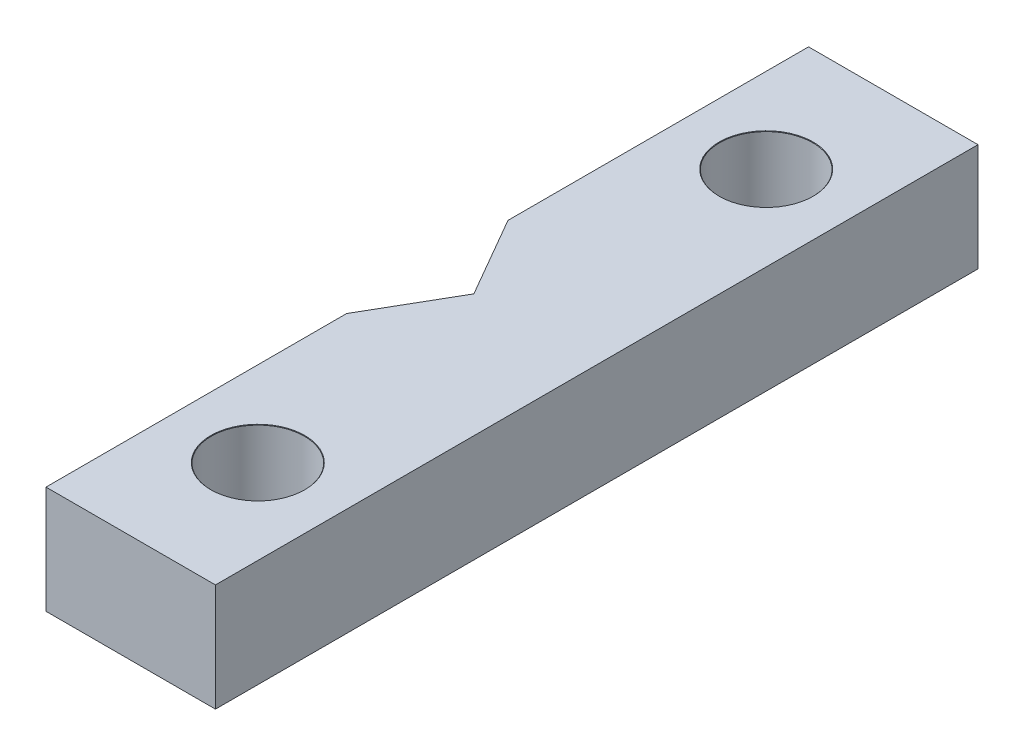
ISO-10303-21;
HEADER;
FILE_DESCRIPTION(('STEP AP214'),'2;1');
FILE_NAME('part.step','',(''),(''),'','','');
FILE_SCHEMA(('AUTOMOTIVE_DESIGN { 1 0 10303 214 1 1 1 1 }'));
ENDSEC;
DATA;
#1=APPLICATION_CONTEXT('core data for automotive mechanical design processes');
#2=APPLICATION_PROTOCOL_DEFINITION('international standard','automotive_design',2000,#1);
#3=PRODUCT_CONTEXT('',#1,'mechanical');
#4=PRODUCT('Part','Part','',(#3));
#5=PRODUCT_RELATED_PRODUCT_CATEGORY('part','',(#4));
#6=PRODUCT_DEFINITION_FORMATION('','',#4);
#7=PRODUCT_DEFINITION_CONTEXT('part definition',#1,'design');
#8=PRODUCT_DEFINITION('design','',#6,#7);
#9=PRODUCT_DEFINITION_SHAPE('','',#8);
#10=(LENGTH_UNIT() NAMED_UNIT(*) SI_UNIT(.MILLI.,.METRE.));
#11=(NAMED_UNIT(*) PLANE_ANGLE_UNIT() SI_UNIT($,.RADIAN.));
#12=(NAMED_UNIT(*) SI_UNIT($,.STERADIAN.) SOLID_ANGLE_UNIT());
#13=UNCERTAINTY_MEASURE_WITH_UNIT(LENGTH_MEASURE(1.E-05),#10,'distance_accuracy_value','');
#14=(GEOMETRIC_REPRESENTATION_CONTEXT(3) GLOBAL_UNCERTAINTY_ASSIGNED_CONTEXT((#13)) GLOBAL_UNIT_ASSIGNED_CONTEXT((#10,
#11,#12)) REPRESENTATION_CONTEXT('',''));
#15=CARTESIAN_POINT('',(0.,0.,0.));
#16=DIRECTION('',(0.,0.,1.));
#17=DIRECTION('',(1.,0.,0.));
#18=AXIS2_PLACEMENT_3D('',#15,#16,#17);
#19=CARTESIAN_POINT('',(10.7493713156446,6.35,0.));
#20=DIRECTION('',(1.,0.,0.));
#21=DIRECTION('',(0.,0.,-1.));
#22=AXIS2_PLACEMENT_3D('',#19,#20,#21);
#23=PLANE('',#22);
#24=DIRECTION('',(0.,0.,1.));
#25=VECTOR('',#24,1.);
#26=CARTESIAN_POINT('',(10.7493713156446,0.,0.));
#27=LINE('',#26,#25);
#28=CARTESIAN_POINT('',(10.7493713156446,0.,-22.5));
#29=VERTEX_POINT('',#28);
#30=CARTESIAN_POINT('',(10.7493713156446,0.,22.5));
#31=VERTEX_POINT('',#30);
#32=EDGE_CURVE('E132',#29,#31,#27,.T.);
#33=ORIENTED_EDGE('',*,*,#32,.F.);
#34=DIRECTION('',(0.,-1.,0.));
#35=VECTOR('',#34,1.);
#36=CARTESIAN_POINT('',(10.7493713156446,6.35,-22.5));
#37=LINE('',#36,#35);
#38=CARTESIAN_POINT('',(10.7493713156446,6.35,-22.5));
#39=VERTEX_POINT('',#38);
#40=EDGE_CURVE('E11',#39,#29,#37,.T.);
#41=ORIENTED_EDGE('',*,*,#40,.F.);
#42=DIRECTION('',(0.,0.,1.));
#43=VECTOR('',#42,1.);
#44=CARTESIAN_POINT('',(10.7493713156446,6.35,0.));
#45=LINE('',#44,#43);
#46=CARTESIAN_POINT('',(10.7493713156446,6.35,22.5));
#47=VERTEX_POINT('',#46);
#48=EDGE_CURVE('E150',#39,#47,#45,.T.);
#49=ORIENTED_EDGE('',*,*,#48,.T.);
#50=DIRECTION('',(0.,-1.,0.));
#51=VECTOR('',#50,1.);
#52=CARTESIAN_POINT('',(10.7493713156446,6.35,22.5));
#53=LINE('',#52,#51);
#54=EDGE_CURVE('E92',#47,#31,#53,.T.);
#55=ORIENTED_EDGE('',*,*,#54,.T.);
#56=EDGE_LOOP('',(#33,#41,#49,#55));
#57=FACE_BOUND('',#56,.T.);
#58=ADVANCED_FACE('F43',(#57),#23,.T.);
#59=CARTESIAN_POINT('',(0.,6.35,-22.5));
#60=DIRECTION('',(0.,0.,-1.));
#61=DIRECTION('',(-1.,0.,0.));
#62=AXIS2_PLACEMENT_3D('',#59,#60,#61);
#63=PLANE('',#62);
#64=DIRECTION('',(1.,0.,0.));
#65=VECTOR('',#64,1.);
#66=CARTESIAN_POINT('',(0.,0.,-22.5));
#67=LINE('',#66,#65);
#68=CARTESIAN_POINT('',(0.749371315644573,0.,-22.5));
#69=VERTEX_POINT('',#68);
#70=EDGE_CURVE('E135',#69,#29,#67,.T.);
#71=ORIENTED_EDGE('',*,*,#70,.F.);
#72=DIRECTION('',(0.,-1.,0.));
#73=VECTOR('',#72,1.);
#74=CARTESIAN_POINT('',(0.749371315644573,6.35,-22.5));
#75=LINE('',#74,#73);
#76=CARTESIAN_POINT('',(0.749371315644573,6.35,-22.5));
#77=VERTEX_POINT('',#76);
#78=EDGE_CURVE('E52',#77,#69,#75,.T.);
#79=ORIENTED_EDGE('',*,*,#78,.F.);
#80=DIRECTION('',(1.,0.,0.));
#81=VECTOR('',#80,1.);
#82=CARTESIAN_POINT('',(0.,6.35,-22.5));
#83=LINE('',#82,#81);
#84=EDGE_CURVE('E170',#77,#39,#83,.T.);
#85=ORIENTED_EDGE('',*,*,#84,.T.);
#86=ORIENTED_EDGE('',*,*,#40,.T.);
#87=EDGE_LOOP('',(#71,#79,#85,#86));
#88=FACE_BOUND('',#87,.T.);
#89=ADVANCED_FACE('F185',(#88),#63,.T.);
#90=CARTESIAN_POINT('',(0.749371315644565,6.35,0.));
#91=DIRECTION('',(-1.,0.,0.));
#92=DIRECTION('',(0.,0.,1.));
#93=AXIS2_PLACEMENT_3D('',#90,#91,#92);
#94=PLANE('',#93);
#95=DIRECTION('',(0.,0.,-1.));
#96=VECTOR('',#95,1.);
#97=CARTESIAN_POINT('',(0.749371315644565,0.,0.));
#98=LINE('',#97,#96);
#99=CARTESIAN_POINT('',(0.749371315644567,0.,-4.76205080756889));
#100=VERTEX_POINT('',#99);
#101=EDGE_CURVE('E139',#100,#69,#98,.T.);
#102=ORIENTED_EDGE('',*,*,#101,.F.);
#103=DIRECTION('',(0.,-1.,0.));
#104=VECTOR('',#103,1.);
#105=CARTESIAN_POINT('',(0.749371315644567,6.35,-4.76205080756889));
#106=LINE('',#105,#104);
#107=CARTESIAN_POINT('',(0.749371315644567,6.35,-4.76205080756889));
#108=VERTEX_POINT('',#107);
#109=EDGE_CURVE('E154',#108,#100,#106,.T.);
#110=ORIENTED_EDGE('',*,*,#109,.F.);
#111=DIRECTION('',(0.,0.,-1.));
#112=VECTOR('',#111,1.);
#113=CARTESIAN_POINT('',(0.749371315644565,6.35,0.));
#114=LINE('',#113,#112);
#115=EDGE_CURVE('E173',#108,#77,#114,.T.);
#116=ORIENTED_EDGE('',*,*,#115,.T.);
#117=ORIENTED_EDGE('',*,*,#78,.T.);
#118=EDGE_LOOP('',(#102,#110,#116,#117));
#119=FACE_BOUND('',#118,.T.);
#120=ADVANCED_FACE('F187',(#119),#94,.T.);
#121=CARTESIAN_POINT('',(2.62405697346685,6.35,-1.515));
#122=DIRECTION('',(-0.866025403784439,0.,0.5));
#123=DIRECTION('',(0.5,0.,0.866025403784439));
#124=AXIS2_PLACEMENT_3D('',#121,#122,#123);
#125=PLANE('',#124);
#126=DIRECTION('',(-0.5,0.,-0.866025403784439));
#127=VECTOR('',#126,1.);
#128=CARTESIAN_POINT('',(2.62405697346685,0.,-1.515));
#129=LINE('',#128,#127);
#130=CARTESIAN_POINT('',(3.49874263128914,0.,0.));
#131=VERTEX_POINT('',#130);
#132=EDGE_CURVE('E142',#131,#100,#129,.T.);
#133=ORIENTED_EDGE('',*,*,#132,.F.);
#134=DIRECTION('',(0.,-1.,0.));
#135=VECTOR('',#134,1.);
#136=CARTESIAN_POINT('',(3.49874263128914,6.35,0.));
#137=LINE('',#136,#135);
#138=CARTESIAN_POINT('',(3.49874263128914,6.35,0.));
#139=VERTEX_POINT('',#138);
#140=EDGE_CURVE('E118',#139,#131,#137,.T.);
#141=ORIENTED_EDGE('',*,*,#140,.F.);
#142=DIRECTION('',(-0.5,0.,-0.866025403784439));
#143=VECTOR('',#142,1.);
#144=CARTESIAN_POINT('',(2.62405697346685,6.35,-1.515));
#145=LINE('',#144,#143);
#146=EDGE_CURVE('E125',#139,#108,#145,.T.);
#147=ORIENTED_EDGE('',*,*,#146,.T.);
#148=ORIENTED_EDGE('',*,*,#109,.T.);
#149=EDGE_LOOP('',(#133,#141,#147,#148));
#150=FACE_BOUND('',#149,.T.);
#151=ADVANCED_FACE('F177',(#150),#125,.T.);
#152=CARTESIAN_POINT('',(2.62405697346685,6.35,1.515));
#153=DIRECTION('',(-0.866025403784438,0.,-0.5));
#154=DIRECTION('',(-0.500000000000001,0.,0.866025403784438));
#155=AXIS2_PLACEMENT_3D('',#152,#153,#154);
#156=PLANE('',#155);
#157=DIRECTION('',(0.5,0.,-0.866025403784438));
#158=VECTOR('',#157,1.);
#159=CARTESIAN_POINT('',(2.62405697346685,0.,1.515));
#160=LINE('',#159,#158);
#161=CARTESIAN_POINT('',(0.749371315644568,0.,4.76205080756889));
#162=VERTEX_POINT('',#161);
#163=EDGE_CURVE('E113',#162,#131,#160,.T.);
#164=ORIENTED_EDGE('',*,*,#163,.F.);
#165=DIRECTION('',(0.,-1.,0.));
#166=VECTOR('',#165,1.);
#167=CARTESIAN_POINT('',(0.749371315644568,6.35,4.76205080756889));
#168=LINE('',#167,#166);
#169=CARTESIAN_POINT('',(0.749371315644568,6.35,4.76205080756889));
#170=VERTEX_POINT('',#169);
#171=EDGE_CURVE('E108',#170,#162,#168,.T.);
#172=ORIENTED_EDGE('',*,*,#171,.F.);
#173=DIRECTION('',(0.5,0.,-0.866025403784438));
#174=VECTOR('',#173,1.);
#175=CARTESIAN_POINT('',(2.62405697346685,6.35,1.515));
#176=LINE('',#175,#174);
#177=EDGE_CURVE('E111',#170,#139,#176,.T.);
#178=ORIENTED_EDGE('',*,*,#177,.T.);
#179=ORIENTED_EDGE('',*,*,#140,.T.);
#180=EDGE_LOOP('',(#164,#172,#178,#179));
#181=FACE_BOUND('',#180,.T.);
#182=ADVANCED_FACE('F110',(#181),#156,.T.);
#183=CARTESIAN_POINT('',(0.749371315644567,6.35,0.));
#184=DIRECTION('',(-1.,0.,0.));
#185=DIRECTION('',(0.,0.,1.));
#186=AXIS2_PLACEMENT_3D('',#183,#184,#185);
#187=PLANE('',#186);
#188=DIRECTION('',(0.,0.,-1.));
#189=VECTOR('',#188,1.);
#190=CARTESIAN_POINT('',(0.749371315644567,0.,0.));
#191=LINE('',#190,#189);
#192=CARTESIAN_POINT('',(0.74937131564457,0.,22.5));
#193=VERTEX_POINT('',#192);
#194=EDGE_CURVE('E146',#193,#162,#191,.T.);
#195=ORIENTED_EDGE('',*,*,#194,.F.);
#196=DIRECTION('',(0.,-1.,0.));
#197=VECTOR('',#196,1.);
#198=CARTESIAN_POINT('',(0.74937131564457,6.35,22.5));
#199=LINE('',#198,#197);
#200=CARTESIAN_POINT('',(0.74937131564457,6.35,22.5));
#201=VERTEX_POINT('',#200);
#202=EDGE_CURVE('E85',#201,#193,#199,.T.);
#203=ORIENTED_EDGE('',*,*,#202,.F.);
#204=DIRECTION('',(0.,0.,-1.));
#205=VECTOR('',#204,1.);
#206=CARTESIAN_POINT('',(0.749371315644567,6.35,0.));
#207=LINE('',#206,#205);
#208=EDGE_CURVE('E122',#201,#170,#207,.T.);
#209=ORIENTED_EDGE('',*,*,#208,.T.);
#210=ORIENTED_EDGE('',*,*,#171,.T.);
#211=EDGE_LOOP('',(#195,#203,#209,#210));
#212=FACE_BOUND('',#211,.T.);
#213=ADVANCED_FACE('F127',(#212),#187,.T.);
#214=CARTESIAN_POINT('',(0.,6.35,22.5));
#215=DIRECTION('',(0.,0.,-1.));
#216=DIRECTION('',(-1.,0.,0.));
#217=AXIS2_PLACEMENT_3D('',#214,#215,#216);
#218=PLANE('',#217);
#219=DIRECTION('',(1.,0.,0.));
#220=VECTOR('',#219,1.);
#221=CARTESIAN_POINT('',(0.,0.,22.5));
#222=LINE('',#221,#220);
#223=EDGE_CURVE('E148',#193,#31,#222,.T.);
#224=ORIENTED_EDGE('',*,*,#223,.T.);
#225=ORIENTED_EDGE('',*,*,#54,.F.);
#226=DIRECTION('',(1.,0.,0.));
#227=VECTOR('',#226,1.);
#228=CARTESIAN_POINT('',(0.,6.35,22.5));
#229=LINE('',#228,#227);
#230=EDGE_CURVE('E61',#201,#47,#229,.T.);
#231=ORIENTED_EDGE('',*,*,#230,.F.);
#232=ORIENTED_EDGE('',*,*,#202,.T.);
#233=EDGE_LOOP('',(#224,#225,#231,#232));
#234=FACE_BOUND('',#233,.T.);
#235=ADVANCED_FACE('F181',(#234),#218,.F.);
#236=CARTESIAN_POINT('',(0.,6.35,0.));
#237=DIRECTION('',(0.,1.,0.));
#238=DIRECTION('',(0.,0.,1.));
#239=AXIS2_PLACEMENT_3D('',#236,#237,#238);
#240=PLANE('',#239);
#241=CARTESIAN_POINT('',(5.74937131564457,6.35,-15.));
#242=DIRECTION('',(0.,1.,0.));
#243=DIRECTION('',(0.,0.,1.));
#244=AXIS2_PLACEMENT_3D('',#241,#242,#243);
#245=CIRCLE('',#244,2.775);
#246=CARTESIAN_POINT('',(5.74937131564457,6.35,-12.225));
#247=VERTEX_POINT('',#246);
#248=EDGE_CURVE('E317',#247,#247,#245,.T.);
#249=ORIENTED_EDGE('',*,*,#248,.F.);
#250=EDGE_LOOP('',(#249));
#251=FACE_BOUND('',#250,.T.);
#252=CARTESIAN_POINT('',(5.74937131564457,6.35,15.));
#253=DIRECTION('',(0.,1.,0.));
#254=DIRECTION('',(0.,0.,1.));
#255=AXIS2_PLACEMENT_3D('',#252,#253,#254);
#256=CIRCLE('',#255,2.775);
#257=CARTESIAN_POINT('',(5.74937131564457,6.35,17.775));
#258=VERTEX_POINT('',#257);
#259=EDGE_CURVE('E161',#258,#258,#256,.T.);
#260=ORIENTED_EDGE('',*,*,#259,.F.);
#261=EDGE_LOOP('',(#260));
#262=FACE_BOUND('',#261,.T.);
#263=ORIENTED_EDGE('',*,*,#48,.F.);
#264=ORIENTED_EDGE('',*,*,#84,.F.);
#265=ORIENTED_EDGE('',*,*,#115,.F.);
#266=ORIENTED_EDGE('',*,*,#146,.F.);
#267=ORIENTED_EDGE('',*,*,#177,.F.);
#268=ORIENTED_EDGE('',*,*,#208,.F.);
#269=ORIENTED_EDGE('',*,*,#230,.T.);
#270=EDGE_LOOP('',(#263,#264,#265,#266,#267,#268,#269));
#271=FACE_BOUND('',#270,.T.);
#272=ADVANCED_FACE('F121',(#251,#262,#271),#240,.T.);
#273=CARTESIAN_POINT('',(0.,0.,0.));
#274=DIRECTION('',(0.,1.,0.));
#275=DIRECTION('',(0.,0.,1.));
#276=AXIS2_PLACEMENT_3D('',#273,#274,#275);
#277=PLANE('',#276);
#278=CARTESIAN_POINT('',(5.74937131564457,0.,-15.));
#279=DIRECTION('',(0.,1.,0.));
#280=DIRECTION('',(0.,0.,1.));
#281=AXIS2_PLACEMENT_3D('',#278,#279,#280);
#282=CIRCLE('',#281,2.75);
#283=CARTESIAN_POINT('',(5.74937131564457,0.,-12.25));
#284=VERTEX_POINT('',#283);
#285=EDGE_CURVE('E46',#284,#284,#282,.T.);
#286=ORIENTED_EDGE('',*,*,#285,.T.);
#287=EDGE_LOOP('',(#286));
#288=FACE_BOUND('',#287,.T.);
#289=CARTESIAN_POINT('',(5.74937131564457,0.,15.));
#290=DIRECTION('',(0.,1.,0.));
#291=DIRECTION('',(0.,0.,1.));
#292=AXIS2_PLACEMENT_3D('',#289,#290,#291);
#293=CIRCLE('',#292,2.75);
#294=CARTESIAN_POINT('',(5.74937131564457,0.,17.75));
#295=VERTEX_POINT('',#294);
#296=EDGE_CURVE('E136',#295,#295,#293,.T.);
#297=ORIENTED_EDGE('',*,*,#296,.T.);
#298=EDGE_LOOP('',(#297));
#299=FACE_BOUND('',#298,.T.);
#300=ORIENTED_EDGE('',*,*,#32,.T.);
#301=ORIENTED_EDGE('',*,*,#223,.F.);
#302=ORIENTED_EDGE('',*,*,#194,.T.);
#303=ORIENTED_EDGE('',*,*,#163,.T.);
#304=ORIENTED_EDGE('',*,*,#132,.T.);
#305=ORIENTED_EDGE('',*,*,#101,.T.);
#306=ORIENTED_EDGE('',*,*,#70,.T.);
#307=EDGE_LOOP('',(#300,#301,#302,#303,#304,#305,#306));
#308=FACE_BOUND('',#307,.T.);
#309=ADVANCED_FACE('F180',(#288,#299,#308),#277,.F.);
#310=CARTESIAN_POINT('',(5.74937131564457,6.35,15.));
#311=DIRECTION('',(0.,1.,0.));
#312=DIRECTION('',(0.,0.,1.));
#313=AXIS2_PLACEMENT_3D('',#310,#311,#312);
#314=CYLINDRICAL_SURFACE('',#313,2.75);
#315=CARTESIAN_POINT('',(5.74937131564457,6.325,15.));
#316=DIRECTION('',(0.,1.,0.));
#317=DIRECTION('',(0.,0.,1.));
#318=AXIS2_PLACEMENT_3D('',#315,#316,#317);
#319=CIRCLE('',#318,2.75);
#320=CARTESIAN_POINT('',(5.74937131564457,6.325,17.75));
#321=VERTEX_POINT('',#320);
#322=EDGE_CURVE('E157',#321,#321,#319,.T.);
#323=ORIENTED_EDGE('',*,*,#322,.T.);
#324=EDGE_LOOP('',(#323));
#325=FACE_BOUND('',#324,.T.);
#326=ORIENTED_EDGE('',*,*,#296,.F.);
#327=EDGE_LOOP('',(#326));
#328=FACE_BOUND('',#327,.T.);
#329=ADVANCED_FACE('F266',(#325,#328),#314,.F.);
#330=CARTESIAN_POINT('',(5.74937131564457,6.35,15.));
#331=DIRECTION('',(0.,1.,0.));
#332=DIRECTION('',(0.,0.,1.));
#333=AXIS2_PLACEMENT_3D('',#330,#331,#332);
#334=CONICAL_SURFACE('',#333,2.775,0.785398163397483);
#335=ORIENTED_EDGE('',*,*,#322,.F.);
#336=EDGE_LOOP('',(#335));
#337=FACE_BOUND('',#336,.T.);
#338=ORIENTED_EDGE('',*,*,#259,.T.);
#339=EDGE_LOOP('',(#338));
#340=FACE_BOUND('',#339,.T.);
#341=ADVANCED_FACE('F279',(#337,#340),#334,.F.);
#342=CARTESIAN_POINT('',(5.74937131564457,6.35,-15.));
#343=DIRECTION('',(0.,1.,0.));
#344=DIRECTION('',(0.,0.,1.));
#345=AXIS2_PLACEMENT_3D('',#342,#343,#344);
#346=CYLINDRICAL_SURFACE('',#345,2.75);
#347=CARTESIAN_POINT('',(5.74937131564457,6.325,-15.));
#348=DIRECTION('',(0.,1.,0.));
#349=DIRECTION('',(0.,0.,1.));
#350=AXIS2_PLACEMENT_3D('',#347,#348,#349);
#351=CIRCLE('',#350,2.75);
#352=CARTESIAN_POINT('',(5.74937131564457,6.325,-12.25));
#353=VERTEX_POINT('',#352);
#354=EDGE_CURVE('E314',#353,#353,#351,.T.);
#355=ORIENTED_EDGE('',*,*,#354,.T.);
#356=EDGE_LOOP('',(#355));
#357=FACE_BOUND('',#356,.T.);
#358=ORIENTED_EDGE('',*,*,#285,.F.);
#359=EDGE_LOOP('',(#358));
#360=FACE_BOUND('',#359,.T.);
#361=ADVANCED_FACE('F288',(#357,#360),#346,.F.);
#362=CARTESIAN_POINT('',(5.74937131564457,6.35,-15.));
#363=DIRECTION('',(0.,1.,0.));
#364=DIRECTION('',(0.,0.,1.));
#365=AXIS2_PLACEMENT_3D('',#362,#363,#364);
#366=CONICAL_SURFACE('',#365,2.775,0.785398163397483);
#367=ORIENTED_EDGE('',*,*,#354,.F.);
#368=EDGE_LOOP('',(#367));
#369=FACE_BOUND('',#368,.T.);
#370=ORIENTED_EDGE('',*,*,#248,.T.);
#371=EDGE_LOOP('',(#370));
#372=FACE_BOUND('',#371,.T.);
#373=ADVANCED_FACE('F298',(#369,#372),#366,.F.);
#374=CLOSED_SHELL('',(#58,#89,#120,#151,#182,#213,#235,#272,#309,#329,#341,#361,#373));
#375=MANIFOLD_SOLID_BREP('B2',#374);
#376=ADVANCED_BREP_SHAPE_REPRESENTATION('',(#18,#375),#14);
#377=SHAPE_DEFINITION_REPRESENTATION(#9,#376);
ENDSEC;
END-ISO-10303-21;
